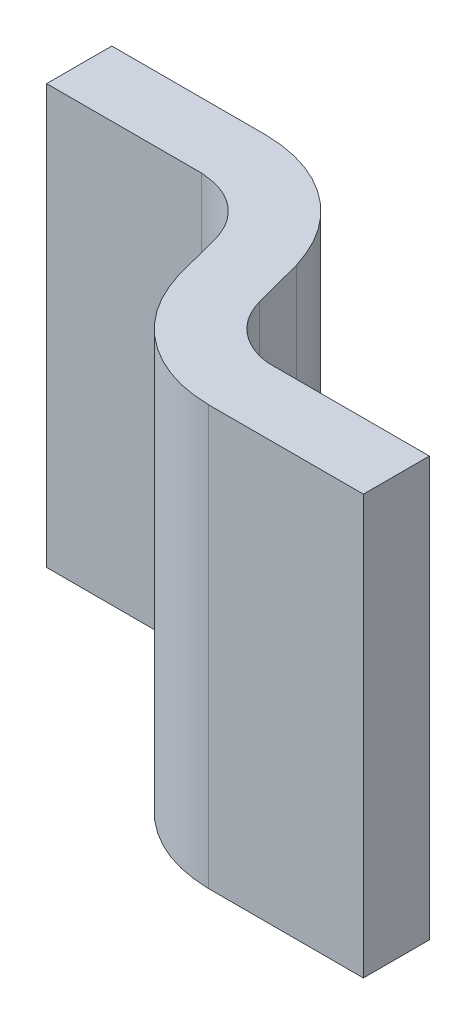
ISO-10303-21;
HEADER;
FILE_DESCRIPTION(('STEP AP214'),'2;1');
FILE_NAME('part.step','',(''),(''),'','','');
FILE_SCHEMA(('AUTOMOTIVE_DESIGN { 1 0 10303 214 1 1 1 1 }'));
ENDSEC;
DATA;
#1=APPLICATION_CONTEXT('core data for automotive mechanical design processes');
#2=APPLICATION_PROTOCOL_DEFINITION('international standard','automotive_design',2000,#1);
#3=PRODUCT_CONTEXT('',#1,'mechanical');
#4=PRODUCT('Part','Part','',(#3));
#5=PRODUCT_RELATED_PRODUCT_CATEGORY('part','',(#4));
#6=PRODUCT_DEFINITION_FORMATION('','',#4);
#7=PRODUCT_DEFINITION_CONTEXT('part definition',#1,'design');
#8=PRODUCT_DEFINITION('design','',#6,#7);
#9=PRODUCT_DEFINITION_SHAPE('','',#8);
#10=(LENGTH_UNIT() NAMED_UNIT(*) SI_UNIT(.MILLI.,.METRE.));
#11=(NAMED_UNIT(*) PLANE_ANGLE_UNIT() SI_UNIT($,.RADIAN.));
#12=(NAMED_UNIT(*) SI_UNIT($,.STERADIAN.) SOLID_ANGLE_UNIT());
#13=UNCERTAINTY_MEASURE_WITH_UNIT(LENGTH_MEASURE(1.E-05),#10,'distance_accuracy_value','');
#14=(GEOMETRIC_REPRESENTATION_CONTEXT(3) GLOBAL_UNCERTAINTY_ASSIGNED_CONTEXT((#13)) GLOBAL_UNIT_ASSIGNED_CONTEXT((#10,
#11,#12)) REPRESENTATION_CONTEXT('',''));
#15=CARTESIAN_POINT('',(0.,0.,0.));
#16=DIRECTION('',(0.,0.,1.));
#17=DIRECTION('',(1.,0.,0.));
#18=AXIS2_PLACEMENT_3D('',#15,#16,#17);
#19=CARTESIAN_POINT('',(-0.876,0.696,0.238));
#20=DIRECTION('',(1.,0.,0.));
#21=DIRECTION('',(0.,0.,1.));
#22=AXIS2_PLACEMENT_3D('',#19,#20,#21);
#23=PLANE('',#22);
#24=DIRECTION('',(0.,-1.,0.));
#25=VECTOR('',#24,1.);
#26=CARTESIAN_POINT('',(-0.876,1.204,0.238));
#27=LINE('',#26,#25);
#28=CARTESIAN_POINT('',(-0.876,1.204,0.238));
#29=VERTEX_POINT('',#28);
#30=CARTESIAN_POINT('',(-0.876,0.696,0.238));
#31=VERTEX_POINT('',#30);
#32=EDGE_CURVE('E11',#29,#31,#27,.T.);
#33=ORIENTED_EDGE('',*,*,#32,.F.);
#34=DIRECTION('',(0.,0.,-1.));
#35=VECTOR('',#34,1.);
#36=CARTESIAN_POINT('',(-0.876,1.204,0.318));
#37=LINE('',#36,#35);
#38=CARTESIAN_POINT('',(-0.876,1.204,0.318));
#39=VERTEX_POINT('',#38);
#40=EDGE_CURVE('E24',#39,#29,#37,.T.);
#41=ORIENTED_EDGE('',*,*,#40,.F.);
#42=DIRECTION('',(0.,1.,0.));
#43=VECTOR('',#42,1.);
#44=CARTESIAN_POINT('',(-0.876,0.696,0.318));
#45=LINE('',#44,#43);
#46=CARTESIAN_POINT('',(-0.876,0.696,0.318));
#47=VERTEX_POINT('',#46);
#48=EDGE_CURVE('E439',#47,#39,#45,.T.);
#49=ORIENTED_EDGE('',*,*,#48,.F.);
#50=DIRECTION('',(0.,0.,1.));
#51=VECTOR('',#50,1.);
#52=CARTESIAN_POINT('',(-0.876,0.696,0.238));
#53=LINE('',#52,#51);
#54=EDGE_CURVE('E437',#31,#47,#53,.T.);
#55=ORIENTED_EDGE('',*,*,#54,.F.);
#56=EDGE_LOOP('',(#33,#41,#49,#55));
#57=FACE_BOUND('',#56,.T.);
#58=ADVANCED_FACE('F17',(#57),#23,.T.);
#59=CARTESIAN_POINT('',(-0.876,0.696,0.318));
#60=DIRECTION('',(0.,0.,1.));
#61=DIRECTION('',(0.,1.,0.));
#62=AXIS2_PLACEMENT_3D('',#59,#60,#61);
#63=PLANE('',#62);
#64=ORIENTED_EDGE('',*,*,#48,.T.);
#65=DIRECTION('',(1.,0.,0.));
#66=VECTOR('',#65,1.);
#67=CARTESIAN_POINT('',(-1.064,1.204,0.318));
#68=LINE('',#67,#66);
#69=CARTESIAN_POINT('',(-1.064,1.204,0.318));
#70=VERTEX_POINT('',#69);
#71=EDGE_CURVE('E435',#70,#39,#68,.T.);
#72=ORIENTED_EDGE('',*,*,#71,.F.);
#73=CARTESIAN_POINT('',(-1.064,0.696,0.31775));
#74=DIRECTION('',(0.,1.,0.));
#75=VECTOR('',#74,1.);
#76=LINE('',#73,#75);
#77=CARTESIAN_POINT('',(-1.064,0.696,0.318));
#78=VERTEX_POINT('',#77);
#79=EDGE_CURVE('E257',#78,#70,#76,.T.);
#80=ORIENTED_EDGE('',*,*,#79,.F.);
#81=DIRECTION('',(-1.,0.,0.));
#82=VECTOR('',#81,1.);
#83=CARTESIAN_POINT('',(-0.876,0.696,0.318));
#84=LINE('',#83,#82);
#85=EDGE_CURVE('E247',#47,#78,#84,.T.);
#86=ORIENTED_EDGE('',*,*,#85,.F.);
#87=EDGE_LOOP('',(#64,#72,#80,#86));
#88=FACE_BOUND('',#87,.T.);
#89=ADVANCED_FACE('F237',(#88),#63,.T.);
#90=CARTESIAN_POINT('',(-0.876,1.204,0.238));
#91=DIRECTION('',(0.,0.,-1.));
#92=DIRECTION('',(0.,1.,0.));
#93=AXIS2_PLACEMENT_3D('',#90,#91,#92);
#94=PLANE('',#93);
#95=ORIENTED_EDGE('',*,*,#32,.T.);
#96=DIRECTION('',(1.,0.,0.));
#97=VECTOR('',#96,1.);
#98=CARTESIAN_POINT('',(-1.064,0.696,0.238));
#99=LINE('',#98,#97);
#100=CARTESIAN_POINT('',(-1.064,0.696,0.238));
#101=VERTEX_POINT('',#100);
#102=EDGE_CURVE('E443',#101,#31,#99,.T.);
#103=ORIENTED_EDGE('',*,*,#102,.F.);
#104=CARTESIAN_POINT('',(-1.064,1.204,0.238375));
#105=DIRECTION('',(0.,-1.,0.));
#106=VECTOR('',#105,1.);
#107=LINE('',#104,#106);
#108=CARTESIAN_POINT('',(-1.064,1.204,0.238));
#109=VERTEX_POINT('',#108);
#110=EDGE_CURVE('E222',#109,#101,#107,.T.);
#111=ORIENTED_EDGE('',*,*,#110,.F.);
#112=DIRECTION('',(-1.,0.,0.));
#113=VECTOR('',#112,1.);
#114=CARTESIAN_POINT('',(-0.876,1.204,0.238));
#115=LINE('',#114,#113);
#116=EDGE_CURVE('E219',#29,#109,#115,.T.);
#117=ORIENTED_EDGE('',*,*,#116,.F.);
#118=EDGE_LOOP('',(#95,#103,#111,#117));
#119=FACE_BOUND('',#118,.T.);
#120=ADVANCED_FACE('F228',(#119),#94,.T.);
#121=CARTESIAN_POINT('',(-1.234,1.204,0.138));
#122=DIRECTION('',(-0.965885549343203,0.,0.258969313954337));
#123=DIRECTION('',(0.258969313954337,0.,0.965885549343203));
#124=AXIS2_PLACEMENT_3D('',#121,#122,#123);
#125=PLANE('',#124);
#126=CARTESIAN_POINT('',(-1.23442187168926,0.696,0.138115055915251));
#127=DIRECTION('',(0.,1.,0.));
#128=VECTOR('',#127,1.);
#129=LINE('',#126,#128);
#130=CARTESIAN_POINT('',(-1.234,0.696,0.138));
#131=VERTEX_POINT('',#130);
#132=CARTESIAN_POINT('',(-1.234,1.204,0.138));
#133=VERTEX_POINT('',#132);
#134=EDGE_CURVE('E215',#131,#133,#129,.T.);
#135=ORIENTED_EDGE('',*,*,#134,.F.);
#136=CARTESIAN_POINT('',(-1.218,0.696,0.2));
#137=DIRECTION('',(-0.258969313954338,0.,-0.965885549343202));
#138=VECTOR('',#137,1.);
#139=LINE('',#136,#138);
#140=CARTESIAN_POINT('',(-1.218,0.696,0.2));
#141=VERTEX_POINT('',#140);
#142=EDGE_CURVE('E301',#141,#131,#139,.T.);
#143=ORIENTED_EDGE('',*,*,#142,.F.);
#144=CARTESIAN_POINT('',(-1.21740631765688,1.204,0.199841941713844));
#145=DIRECTION('',(0.,-1.,0.));
#146=VECTOR('',#145,1.);
#147=LINE('',#144,#146);
#148=CARTESIAN_POINT('',(-1.218,1.204,0.2));
#149=VERTEX_POINT('',#148);
#150=EDGE_CURVE('E288',#149,#141,#147,.T.);
#151=ORIENTED_EDGE('',*,*,#150,.F.);
#152=DIRECTION('',(0.258969313954337,0.,0.965885549343203));
#153=VECTOR('',#152,1.);
#154=CARTESIAN_POINT('',(-1.234,1.204,0.138));
#155=LINE('',#154,#153);
#156=EDGE_CURVE('E356',#133,#149,#155,.T.);
#157=ORIENTED_EDGE('',*,*,#156,.F.);
#158=EDGE_LOOP('',(#135,#143,#151,#157));
#159=FACE_BOUND('',#158,.T.);
#160=ADVANCED_FACE('F236',(#159),#125,.T.);
#161=CARTESIAN_POINT('',(-1.157,0.696,0.118));
#162=DIRECTION('',(0.965885549343203,0.,-0.258969313954337));
#163=DIRECTION('',(0.258969313954337,0.,0.965885549343203));
#164=AXIS2_PLACEMENT_3D('',#161,#162,#163);
#165=PLANE('',#164);
#166=CARTESIAN_POINT('',(-1.15759368234312,1.204,0.118158058286156));
#167=DIRECTION('',(0.,-1.,0.));
#168=VECTOR('',#167,1.);
#169=LINE('',#166,#168);
#170=CARTESIAN_POINT('',(-1.157,1.204,0.118));
#171=VERTEX_POINT('',#170);
#172=CARTESIAN_POINT('',(-1.157,0.696,0.118));
#173=VERTEX_POINT('',#172);
#174=EDGE_CURVE('E342',#171,#173,#169,.T.);
#175=ORIENTED_EDGE('',*,*,#174,.F.);
#176=CARTESIAN_POINT('',(-1.141,1.204,0.179));
#177=DIRECTION('',(-0.258969313954335,0.,-0.965885549343203));
#178=VECTOR('',#177,1.);
#179=LINE('',#176,#178);
#180=CARTESIAN_POINT('',(-1.141,1.204,0.179));
#181=VERTEX_POINT('',#180);
#182=EDGE_CURVE('E330',#181,#171,#179,.T.);
#183=ORIENTED_EDGE('',*,*,#182,.F.);
#184=CARTESIAN_POINT('',(-1.14082576891933,0.696,0.178954745173853));
#185=DIRECTION('',(0.,1.,0.));
#186=VECTOR('',#185,1.);
#187=LINE('',#184,#186);
#188=CARTESIAN_POINT('',(-1.141,0.696,0.179));
#189=VERTEX_POINT('',#188);
#190=EDGE_CURVE('E366',#189,#181,#187,.T.);
#191=ORIENTED_EDGE('',*,*,#190,.F.);
#192=DIRECTION('',(0.258969313954337,0.,0.965885549343203));
#193=VECTOR('',#192,1.);
#194=CARTESIAN_POINT('',(-1.157,0.696,0.118));
#195=LINE('',#194,#193);
#196=EDGE_CURVE('E368',#173,#189,#195,.T.);
#197=ORIENTED_EDGE('',*,*,#196,.F.);
#198=EDGE_LOOP('',(#175,#183,#191,#197));
#199=FACE_BOUND('',#198,.T.);
#200=ADVANCED_FACE('F160',(#199),#165,.T.);
#201=CARTESIAN_POINT('',(-1.499,1.204,0.079));
#202=DIRECTION('',(0.,0.,1.));
#203=DIRECTION('',(0.,1.,0.));
#204=AXIS2_PLACEMENT_3D('',#201,#202,#203);
#205=PLANE('',#204);
#206=DIRECTION('',(0.,1.,0.));
#207=VECTOR('',#206,1.);
#208=CARTESIAN_POINT('',(-1.499,0.696,0.079));
#209=LINE('',#208,#207);
#210=CARTESIAN_POINT('',(-1.499,0.696,0.079));
#211=VERTEX_POINT('',#210);
#212=CARTESIAN_POINT('',(-1.499,1.204,0.079));
#213=VERTEX_POINT('',#212);
#214=EDGE_CURVE('E125',#211,#213,#209,.T.);
#215=ORIENTED_EDGE('',*,*,#214,.F.);
#216=DIRECTION('',(-1.,0.,0.));
#217=VECTOR('',#216,1.);
#218=CARTESIAN_POINT('',(-1.311,0.696,0.079));
#219=LINE('',#218,#217);
#220=CARTESIAN_POINT('',(-1.311,0.696,0.079));
#221=VERTEX_POINT('',#220);
#222=EDGE_CURVE('E377',#221,#211,#219,.T.);
#223=ORIENTED_EDGE('',*,*,#222,.F.);
#224=CARTESIAN_POINT('',(-1.311,1.204,0.079625));
#225=DIRECTION('',(0.,-1.,0.));
#226=VECTOR('',#225,1.);
#227=LINE('',#224,#226);
#228=CARTESIAN_POINT('',(-1.311,1.204,0.079));
#229=VERTEX_POINT('',#228);
#230=EDGE_CURVE('E178',#229,#221,#227,.T.);
#231=ORIENTED_EDGE('',*,*,#230,.F.);
#232=DIRECTION('',(1.,0.,0.));
#233=VECTOR('',#232,1.);
#234=CARTESIAN_POINT('',(-1.499,1.204,0.079));
#235=LINE('',#234,#233);
#236=EDGE_CURVE('E169',#213,#229,#235,.T.);
#237=ORIENTED_EDGE('',*,*,#236,.F.);
#238=EDGE_LOOP('',(#215,#223,#231,#237));
#239=FACE_BOUND('',#238,.T.);
#240=ADVANCED_FACE('F155',(#239),#205,.T.);
#241=CARTESIAN_POINT('',(-1.311,1.204,0.));
#242=DIRECTION('',(0.,0.,-1.));
#243=DIRECTION('',(0.,1.,0.));
#244=AXIS2_PLACEMENT_3D('',#241,#242,#243);
#245=PLANE('',#244);
#246=CARTESIAN_POINT('',(-1.311,0.696,0.000249999999999979));
#247=DIRECTION('',(0.,1.,0.));
#248=VECTOR('',#247,1.);
#249=LINE('',#246,#248);
#250=CARTESIAN_POINT('',(-1.311,0.696,0.));
#251=VERTEX_POINT('',#250);
#252=CARTESIAN_POINT('',(-1.311,1.204,0.));
#253=VERTEX_POINT('',#252);
#254=EDGE_CURVE('E140',#251,#253,#249,.T.);
#255=ORIENTED_EDGE('',*,*,#254,.F.);
#256=DIRECTION('',(1.,0.,0.));
#257=VECTOR('',#256,1.);
#258=CARTESIAN_POINT('',(-1.499,0.696,0.));
#259=LINE('',#258,#257);
#260=CARTESIAN_POINT('',(-1.499,0.696,0.));
#261=VERTEX_POINT('',#260);
#262=EDGE_CURVE('E107',#261,#251,#259,.T.);
#263=ORIENTED_EDGE('',*,*,#262,.F.);
#264=DIRECTION('',(0.,-1.,0.));
#265=VECTOR('',#264,1.);
#266=CARTESIAN_POINT('',(-1.499,1.204,0.));
#267=LINE('',#266,#265);
#268=CARTESIAN_POINT('',(-1.499,1.204,0.));
#269=VERTEX_POINT('',#268);
#270=EDGE_CURVE('E101',#269,#261,#267,.T.);
#271=ORIENTED_EDGE('',*,*,#270,.F.);
#272=DIRECTION('',(-1.,0.,0.));
#273=VECTOR('',#272,1.);
#274=CARTESIAN_POINT('',(-1.311,1.204,0.));
#275=LINE('',#274,#273);
#276=EDGE_CURVE('E104',#253,#269,#275,.T.);
#277=ORIENTED_EDGE('',*,*,#276,.F.);
#278=EDGE_LOOP('',(#255,#263,#271,#277));
#279=FACE_BOUND('',#278,.T.);
#280=ADVANCED_FACE('F103',(#279),#245,.T.);
#281=CARTESIAN_POINT('',(-1.499,1.204,0.));
#282=DIRECTION('',(-1.,0.,0.));
#283=DIRECTION('',(0.,0.,1.));
#284=AXIS2_PLACEMENT_3D('',#281,#282,#283);
#285=PLANE('',#284);
#286=ORIENTED_EDGE('',*,*,#270,.T.);
#287=DIRECTION('',(0.,0.,-1.));
#288=VECTOR('',#287,1.);
#289=CARTESIAN_POINT('',(-1.499,0.696,0.079));
#290=LINE('',#289,#288);
#291=EDGE_CURVE('E122',#211,#261,#290,.T.);
#292=ORIENTED_EDGE('',*,*,#291,.F.);
#293=ORIENTED_EDGE('',*,*,#214,.T.);
#294=DIRECTION('',(0.,0.,1.));
#295=VECTOR('',#294,1.);
#296=CARTESIAN_POINT('',(-1.499,1.204,0.));
#297=LINE('',#296,#295);
#298=EDGE_CURVE('E118',#269,#213,#297,.T.);
#299=ORIENTED_EDGE('',*,*,#298,.F.);
#300=EDGE_LOOP('',(#286,#292,#293,#299));
#301=FACE_BOUND('',#300,.T.);
#302=ADVANCED_FACE('F124',(#301),#285,.T.);
#303=CARTESIAN_POINT('',(-1.064,0.696,0.159));
#304=DIRECTION('',(0.,-1.,0.));
#305=DIRECTION('',(0.,0.,1.));
#306=AXIS2_PLACEMENT_3D('',#303,#304,#305);
#307=CYLINDRICAL_SURFACE('',#306,0.15875);
#308=ORIENTED_EDGE('',*,*,#79,.T.);
#309=CARTESIAN_POINT('',(-1.064,1.204,0.159));
#310=DIRECTION('',(0.,1.,0.));
#311=DIRECTION('',(0.793107076683516,0.,0.609082231652284));
#312=AXIS2_PLACEMENT_3D('',#309,#310,#311);
#313=CIRCLE('',#312,0.15875);
#314=EDGE_CURVE('E127',#149,#70,#313,.T.);
#315=ORIENTED_EDGE('',*,*,#314,.F.);
#316=ORIENTED_EDGE('',*,*,#150,.T.);
#317=CARTESIAN_POINT('',(-1.064,0.696,0.159));
#318=DIRECTION('',(0.,-1.,0.));
#319=DIRECTION('',(-0.793107076683516,0.,-0.609082231652284));
#320=AXIS2_PLACEMENT_3D('',#317,#318,#319);
#321=CIRCLE('',#320,0.15875);
#322=EDGE_CURVE('E131',#78,#141,#321,.T.);
#323=ORIENTED_EDGE('',*,*,#322,.F.);
#324=EDGE_LOOP('',(#308,#315,#316,#323));
#325=FACE_BOUND('',#324,.T.);
#326=ADVANCED_FACE('F263',(#325),#307,.T.);
#327=CARTESIAN_POINT('',(-1.064,1.204,0.159));
#328=DIRECTION('',(0.,-1.,0.));
#329=DIRECTION('',(0.,0.,-1.));
#330=AXIS2_PLACEMENT_3D('',#327,#328,#329);
#331=CYLINDRICAL_SURFACE('',#330,0.079375);
#332=ORIENTED_EDGE('',*,*,#110,.T.);
#333=CARTESIAN_POINT('',(-1.064,0.696,0.159));
#334=DIRECTION('',(0.,1.,0.));
#335=DIRECTION('',(0.793107076683516,0.,0.609082231652284));
#336=AXIS2_PLACEMENT_3D('',#333,#334,#335);
#337=CIRCLE('',#336,0.079375);
#338=EDGE_CURVE('E427',#189,#101,#337,.T.);
#339=ORIENTED_EDGE('',*,*,#338,.F.);
#340=ORIENTED_EDGE('',*,*,#190,.T.);
#341=CARTESIAN_POINT('',(-1.064,1.204,0.159));
#342=DIRECTION('',(0.,-1.,0.));
#343=DIRECTION('',(-0.793107076683516,0.,-0.609082231652284));
#344=AXIS2_PLACEMENT_3D('',#341,#342,#343);
#345=CIRCLE('',#344,0.079375);
#346=EDGE_CURVE('E423',#109,#181,#345,.T.);
#347=ORIENTED_EDGE('',*,*,#346,.F.);
#348=EDGE_LOOP('',(#332,#339,#340,#347));
#349=FACE_BOUND('',#348,.T.);
#350=ADVANCED_FACE('F195',(#349),#331,.F.);
#351=CARTESIAN_POINT('',(-1.311,1.204,0.159));
#352=DIRECTION('',(0.,-1.,0.));
#353=DIRECTION('',(0.,0.,1.));
#354=AXIS2_PLACEMENT_3D('',#351,#352,#353);
#355=CYLINDRICAL_SURFACE('',#354,0.079375);
#356=ORIENTED_EDGE('',*,*,#230,.T.);
#357=CARTESIAN_POINT('',(-1.311,0.696,0.159));
#358=DIRECTION('',(0.,1.,0.));
#359=DIRECTION('',(-0.793107076683516,0.,-0.609082231652284));
#360=AXIS2_PLACEMENT_3D('',#357,#358,#359);
#361=CIRCLE('',#360,0.079375);
#362=EDGE_CURVE('E418',#131,#221,#361,.T.);
#363=ORIENTED_EDGE('',*,*,#362,.F.);
#364=ORIENTED_EDGE('',*,*,#134,.T.);
#365=CARTESIAN_POINT('',(-1.311,1.204,0.159));
#366=DIRECTION('',(0.,-1.,0.));
#367=DIRECTION('',(0.793107076683516,0.,0.609082231652284));
#368=AXIS2_PLACEMENT_3D('',#365,#366,#367);
#369=CIRCLE('',#368,0.079375);
#370=EDGE_CURVE('E408',#229,#133,#369,.T.);
#371=ORIENTED_EDGE('',*,*,#370,.F.);
#372=EDGE_LOOP('',(#356,#363,#364,#371));
#373=FACE_BOUND('',#372,.T.);
#374=ADVANCED_FACE('F184',(#373),#355,.F.);
#375=CARTESIAN_POINT('',(-1.311,1.204,0.159));
#376=DIRECTION('',(0.,-1.,0.));
#377=DIRECTION('',(0.,0.,-1.));
#378=AXIS2_PLACEMENT_3D('',#375,#376,#377);
#379=CYLINDRICAL_SURFACE('',#378,0.15875);
#380=ORIENTED_EDGE('',*,*,#254,.T.);
#381=CARTESIAN_POINT('',(-1.311,1.204,0.159));
#382=DIRECTION('',(0.,1.,0.));
#383=DIRECTION('',(-0.793107076683516,0.,-0.609082231652284));
#384=AXIS2_PLACEMENT_3D('',#381,#382,#383);
#385=CIRCLE('',#384,0.15875);
#386=EDGE_CURVE('E121',#171,#253,#385,.T.);
#387=ORIENTED_EDGE('',*,*,#386,.F.);
#388=ORIENTED_EDGE('',*,*,#174,.T.);
#389=CARTESIAN_POINT('',(-1.311,0.696,0.159));
#390=DIRECTION('',(0.,-1.,0.));
#391=DIRECTION('',(0.793107076683516,0.,0.609082231652284));
#392=AXIS2_PLACEMENT_3D('',#389,#390,#391);
#393=CIRCLE('',#392,0.15875);
#394=EDGE_CURVE('E405',#251,#173,#393,.T.);
#395=ORIENTED_EDGE('',*,*,#394,.F.);
#396=EDGE_LOOP('',(#380,#387,#388,#395));
#397=FACE_BOUND('',#396,.T.);
#398=ADVANCED_FACE('F194',(#397),#379,.T.);
#399=CARTESIAN_POINT('',(-0.876,1.204,0.238));
#400=DIRECTION('',(0.,1.,0.));
#401=DIRECTION('',(1.,0.,0.));
#402=AXIS2_PLACEMENT_3D('',#399,#400,#401);
#403=PLANE('',#402);
#404=ORIENTED_EDGE('',*,*,#71,.T.);
#405=ORIENTED_EDGE('',*,*,#40,.T.);
#406=ORIENTED_EDGE('',*,*,#116,.T.);
#407=ORIENTED_EDGE('',*,*,#346,.T.);
#408=ORIENTED_EDGE('',*,*,#182,.T.);
#409=ORIENTED_EDGE('',*,*,#386,.T.);
#410=ORIENTED_EDGE('',*,*,#276,.T.);
#411=ORIENTED_EDGE('',*,*,#298,.T.);
#412=ORIENTED_EDGE('',*,*,#236,.T.);
#413=ORIENTED_EDGE('',*,*,#370,.T.);
#414=ORIENTED_EDGE('',*,*,#156,.T.);
#415=ORIENTED_EDGE('',*,*,#314,.T.);
#416=EDGE_LOOP('',(#404,#405,#406,#407,#408,#409,#410,#411,#412,#413,#414,#415));
#417=FACE_BOUND('',#416,.T.);
#418=ADVANCED_FACE('F116',(#417),#403,.T.);
#419=CARTESIAN_POINT('',(-1.311,0.696,0.079));
#420=DIRECTION('',(0.,-1.,0.));
#421=DIRECTION('',(1.,0.,0.));
#422=AXIS2_PLACEMENT_3D('',#419,#420,#421);
#423=PLANE('',#422);
#424=ORIENTED_EDGE('',*,*,#102,.T.);
#425=ORIENTED_EDGE('',*,*,#54,.T.);
#426=ORIENTED_EDGE('',*,*,#85,.T.);
#427=ORIENTED_EDGE('',*,*,#322,.T.);
#428=ORIENTED_EDGE('',*,*,#142,.T.);
#429=ORIENTED_EDGE('',*,*,#362,.T.);
#430=ORIENTED_EDGE('',*,*,#222,.T.);
#431=ORIENTED_EDGE('',*,*,#291,.T.);
#432=ORIENTED_EDGE('',*,*,#262,.T.);
#433=ORIENTED_EDGE('',*,*,#394,.T.);
#434=ORIENTED_EDGE('',*,*,#196,.T.);
#435=ORIENTED_EDGE('',*,*,#338,.T.);
#436=EDGE_LOOP('',(#424,#425,#426,#427,#428,#429,#430,#431,#432,#433,#434,#435));
#437=FACE_BOUND('',#436,.T.);
#438=ADVANCED_FACE('F306',(#437),#423,.T.);
#439=CLOSED_SHELL('',(#58,#89,#120,#160,#200,#240,#280,#302,#326,#350,#374,#398,#418,#438));
#440=MANIFOLD_SOLID_BREP('B1',#439);
#441=ADVANCED_BREP_SHAPE_REPRESENTATION('',(#18,#440),#14);
#442=SHAPE_DEFINITION_REPRESENTATION(#9,#441);
ENDSEC;
END-ISO-10303-21;
